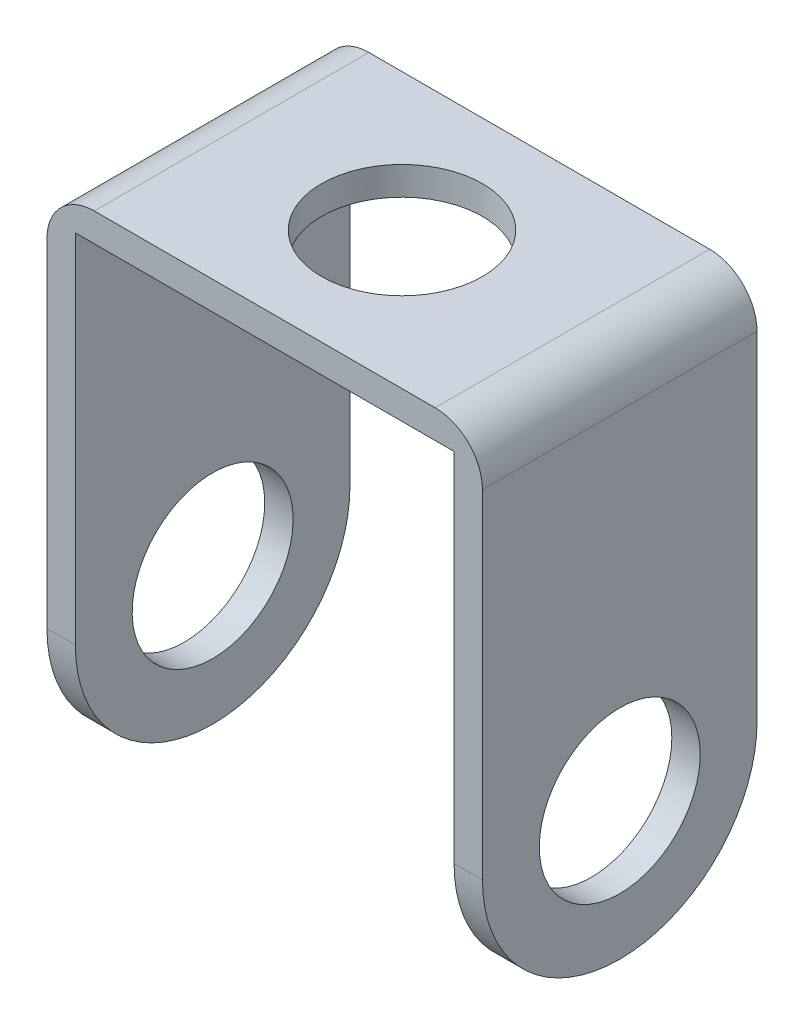
ISO-10303-21;
HEADER;
FILE_DESCRIPTION(('STEP AP214'),'2;1');
FILE_NAME('part.step','',(''),(''),'','','');
FILE_SCHEMA(('AUTOMOTIVE_DESIGN { 1 0 10303 214 1 1 1 1 }'));
ENDSEC;
DATA;
#1=APPLICATION_CONTEXT('core data for automotive mechanical design processes');
#2=APPLICATION_PROTOCOL_DEFINITION('international standard','automotive_design',2000,#1);
#3=PRODUCT_CONTEXT('',#1,'mechanical');
#4=PRODUCT('Part','Part','',(#3));
#5=PRODUCT_RELATED_PRODUCT_CATEGORY('part','',(#4));
#6=PRODUCT_DEFINITION_FORMATION('','',#4);
#7=PRODUCT_DEFINITION_CONTEXT('part definition',#1,'design');
#8=PRODUCT_DEFINITION('design','',#6,#7);
#9=PRODUCT_DEFINITION_SHAPE('','',#8);
#10=(LENGTH_UNIT() NAMED_UNIT(*) SI_UNIT(.MILLI.,.METRE.));
#11=(NAMED_UNIT(*) PLANE_ANGLE_UNIT() SI_UNIT($,.RADIAN.));
#12=(NAMED_UNIT(*) SI_UNIT($,.STERADIAN.) SOLID_ANGLE_UNIT());
#13=UNCERTAINTY_MEASURE_WITH_UNIT(LENGTH_MEASURE(1.E-05),#10,'distance_accuracy_value','');
#14=(GEOMETRIC_REPRESENTATION_CONTEXT(3) GLOBAL_UNCERTAINTY_ASSIGNED_CONTEXT((#13)) GLOBAL_UNIT_ASSIGNED_CONTEXT((#10,
#11,#12)) REPRESENTATION_CONTEXT('',''));
#15=CARTESIAN_POINT('',(0.,0.,0.));
#16=DIRECTION('',(0.,0.,1.));
#17=DIRECTION('',(1.,0.,0.));
#18=AXIS2_PLACEMENT_3D('',#15,#16,#17);
#19=CARTESIAN_POINT('',(0.,0.,7.25));
#20=DIRECTION('',(1.,0.,0.));
#21=DIRECTION('',(0.,0.,-1.));
#22=AXIS2_PLACEMENT_3D('',#19,#20,#21);
#23=PLANE('',#22);
#24=CARTESIAN_POINT('',(0.,3.625,3.625));
#25=DIRECTION('',(1.,0.,0.));
#26=DIRECTION('',(0.,0.,-1.));
#27=AXIS2_PLACEMENT_3D('',#24,#25,#26);
#28=CIRCLE('',#27,2.125);
#29=CARTESIAN_POINT('',(0.,3.625,1.5));
#30=VERTEX_POINT('',#29);
#31=EDGE_CURVE('E115',#30,#30,#28,.T.);
#32=ORIENTED_EDGE('',*,*,#31,.T.);
#33=EDGE_LOOP('',(#32));
#34=FACE_BOUND('',#33,.T.);
#35=CARTESIAN_POINT('',(0.,3.625,3.625));
#36=DIRECTION('',(1.,0.,0.));
#37=DIRECTION('',(0.,0.,-1.));
#38=AXIS2_PLACEMENT_3D('',#35,#36,#37);
#39=CIRCLE('',#38,3.625);
#40=CARTESIAN_POINT('',(0.,3.625,7.25));
#41=VERTEX_POINT('',#40);
#42=CARTESIAN_POINT('',(0.,3.625,0.));
#43=VERTEX_POINT('',#42);
#44=EDGE_CURVE('E48',#41,#43,#39,.T.);
#45=ORIENTED_EDGE('',*,*,#44,.F.);
#46=DIRECTION('',(0.,-1.,0.));
#47=VECTOR('',#46,1.);
#48=CARTESIAN_POINT('',(0.,0.,7.25));
#49=LINE('',#48,#47);
#50=CARTESIAN_POINT('',(0.,12.55,7.25));
#51=VERTEX_POINT('',#50);
#52=EDGE_CURVE('E198',#51,#41,#49,.T.);
#53=ORIENTED_EDGE('',*,*,#52,.F.);
#54=DIRECTION('',(0.,0.,-1.));
#55=VECTOR('',#54,1.);
#56=CARTESIAN_POINT('',(0.,12.55,7.25));
#57=LINE('',#56,#55);
#58=CARTESIAN_POINT('',(0.,12.55,0.));
#59=VERTEX_POINT('',#58);
#60=EDGE_CURVE('E169',#51,#59,#57,.T.);
#61=ORIENTED_EDGE('',*,*,#60,.T.);
#62=DIRECTION('',(0.,-1.,0.));
#63=VECTOR('',#62,1.);
#64=CARTESIAN_POINT('',(0.,0.,0.));
#65=LINE('',#64,#63);
#66=EDGE_CURVE('E140',#59,#43,#65,.T.);
#67=ORIENTED_EDGE('',*,*,#66,.T.);
#68=EDGE_LOOP('',(#45,#53,#61,#67));
#69=FACE_BOUND('',#68,.T.);
#70=ADVANCED_FACE('F31',(#34,#69),#23,.F.);
#71=CARTESIAN_POINT('',(0.749999999999999,13.05,7.25));
#72=DIRECTION('',(-1.,0.,0.));
#73=DIRECTION('',(0.,-1.,0.));
#74=AXIS2_PLACEMENT_3D('',#71,#72,#73);
#75=PLANE('',#74);
#76=CARTESIAN_POINT('',(0.750000000000001,3.625,3.625));
#77=DIRECTION('',(-1.,0.,0.));
#78=DIRECTION('',(0.,-1.,0.));
#79=AXIS2_PLACEMENT_3D('',#76,#77,#78);
#80=CIRCLE('',#79,2.125);
#81=CARTESIAN_POINT('',(0.750000000000001,1.5,3.625));
#82=VERTEX_POINT('',#81);
#83=EDGE_CURVE('E180',#82,#82,#80,.T.);
#84=ORIENTED_EDGE('',*,*,#83,.T.);
#85=EDGE_LOOP('',(#84));
#86=FACE_BOUND('',#85,.T.);
#87=DIRECTION('',(0.,1.,0.));
#88=VECTOR('',#87,1.);
#89=CARTESIAN_POINT('',(0.749999999999999,13.05,7.25));
#90=LINE('',#89,#88);
#91=CARTESIAN_POINT('',(0.750000000000001,3.625,7.25));
#92=VERTEX_POINT('',#91);
#93=CARTESIAN_POINT('',(0.749999999999999,13.05,7.25));
#94=VERTEX_POINT('',#93);
#95=EDGE_CURVE('E201',#92,#94,#90,.T.);
#96=ORIENTED_EDGE('',*,*,#95,.F.);
#97=CARTESIAN_POINT('',(0.750000000000001,3.625,3.625));
#98=DIRECTION('',(-1.,0.,0.));
#99=DIRECTION('',(0.,-1.,0.));
#100=AXIS2_PLACEMENT_3D('',#97,#98,#99);
#101=CIRCLE('',#100,3.625);
#102=CARTESIAN_POINT('',(0.750000000000001,3.625,0.));
#103=VERTEX_POINT('',#102);
#104=EDGE_CURVE('E193',#103,#92,#101,.T.);
#105=ORIENTED_EDGE('',*,*,#104,.F.);
#106=DIRECTION('',(0.,1.,0.));
#107=VECTOR('',#106,1.);
#108=CARTESIAN_POINT('',(0.749999999999999,13.05,0.));
#109=LINE('',#108,#107);
#110=CARTESIAN_POINT('',(0.749999999999999,13.05,0.));
#111=VERTEX_POINT('',#110);
#112=EDGE_CURVE('E143',#103,#111,#109,.T.);
#113=ORIENTED_EDGE('',*,*,#112,.T.);
#114=DIRECTION('',(0.,0.,-1.));
#115=VECTOR('',#114,1.);
#116=CARTESIAN_POINT('',(0.749999999999999,13.05,7.25));
#117=LINE('',#116,#115);
#118=EDGE_CURVE('E166',#94,#111,#117,.T.);
#119=ORIENTED_EDGE('',*,*,#118,.F.);
#120=EDGE_LOOP('',(#96,#105,#113,#119));
#121=FACE_BOUND('',#120,.T.);
#122=ADVANCED_FACE('F232',(#86,#121),#75,.F.);
#123=CARTESIAN_POINT('',(10.75,0.,7.25));
#124=DIRECTION('',(1.,0.,0.));
#125=DIRECTION('',(0.,0.,-1.));
#126=AXIS2_PLACEMENT_3D('',#123,#124,#125);
#127=PLANE('',#126);
#128=CARTESIAN_POINT('',(10.75,3.625,3.625));
#129=DIRECTION('',(1.,0.,0.));
#130=DIRECTION('',(0.,0.,-1.));
#131=AXIS2_PLACEMENT_3D('',#128,#129,#130);
#132=CIRCLE('',#131,2.125);
#133=CARTESIAN_POINT('',(10.75,3.625,1.5));
#134=VERTEX_POINT('',#133);
#135=EDGE_CURVE('E175',#134,#134,#132,.T.);
#136=ORIENTED_EDGE('',*,*,#135,.T.);
#137=EDGE_LOOP('',(#136));
#138=FACE_BOUND('',#137,.T.);
#139=CARTESIAN_POINT('',(10.75,3.625,3.625));
#140=DIRECTION('',(1.,0.,0.));
#141=DIRECTION('',(0.,0.,-1.));
#142=AXIS2_PLACEMENT_3D('',#139,#140,#141);
#143=CIRCLE('',#142,3.625);
#144=CARTESIAN_POINT('',(10.75,3.625,7.25));
#145=VERTEX_POINT('',#144);
#146=CARTESIAN_POINT('',(10.75,3.625,0.));
#147=VERTEX_POINT('',#146);
#148=EDGE_CURVE('E55',#145,#147,#143,.T.);
#149=ORIENTED_EDGE('',*,*,#148,.F.);
#150=DIRECTION('',(0.,-1.,0.));
#151=VECTOR('',#150,1.);
#152=CARTESIAN_POINT('',(10.75,0.,7.25));
#153=LINE('',#152,#151);
#154=CARTESIAN_POINT('',(10.75,13.05,7.25));
#155=VERTEX_POINT('',#154);
#156=EDGE_CURVE('E122',#155,#145,#153,.T.);
#157=ORIENTED_EDGE('',*,*,#156,.F.);
#158=DIRECTION('',(0.,0.,-1.));
#159=VECTOR('',#158,1.);
#160=CARTESIAN_POINT('',(10.75,13.05,7.25));
#161=LINE('',#160,#159);
#162=CARTESIAN_POINT('',(10.75,13.05,0.));
#163=VERTEX_POINT('',#162);
#164=EDGE_CURVE('E163',#155,#163,#161,.T.);
#165=ORIENTED_EDGE('',*,*,#164,.T.);
#166=DIRECTION('',(0.,-1.,0.));
#167=VECTOR('',#166,1.);
#168=CARTESIAN_POINT('',(10.75,0.,0.));
#169=LINE('',#168,#167);
#170=EDGE_CURVE('E147',#163,#147,#169,.T.);
#171=ORIENTED_EDGE('',*,*,#170,.T.);
#172=EDGE_LOOP('',(#149,#157,#165,#171));
#173=FACE_BOUND('',#172,.T.);
#174=ADVANCED_FACE('F212',(#138,#173),#127,.F.);
#175=CARTESIAN_POINT('',(11.5,12.55,7.25));
#176=DIRECTION('',(-1.,0.,0.));
#177=DIRECTION('',(0.,0.,1.));
#178=AXIS2_PLACEMENT_3D('',#175,#176,#177);
#179=PLANE('',#178);
#180=CARTESIAN_POINT('',(11.5,3.625,3.625));
#181=DIRECTION('',(-1.,0.,0.));
#182=DIRECTION('',(0.,0.,1.));
#183=AXIS2_PLACEMENT_3D('',#180,#181,#182);
#184=CIRCLE('',#183,2.125);
#185=CARTESIAN_POINT('',(11.5,3.625,5.75));
#186=VERTEX_POINT('',#185);
#187=EDGE_CURVE('E173',#186,#186,#184,.T.);
#188=ORIENTED_EDGE('',*,*,#187,.T.);
#189=EDGE_LOOP('',(#188));
#190=FACE_BOUND('',#189,.T.);
#191=DIRECTION('',(0.,1.,0.));
#192=VECTOR('',#191,1.);
#193=CARTESIAN_POINT('',(11.5,12.55,7.25));
#194=LINE('',#193,#192);
#195=CARTESIAN_POINT('',(11.5,3.625,7.25));
#196=VERTEX_POINT('',#195);
#197=CARTESIAN_POINT('',(11.5,12.55,7.25));
#198=VERTEX_POINT('',#197);
#199=EDGE_CURVE('E119',#196,#198,#194,.T.);
#200=ORIENTED_EDGE('',*,*,#199,.F.);
#201=CARTESIAN_POINT('',(11.5,3.625,3.625));
#202=DIRECTION('',(-1.,0.,0.));
#203=DIRECTION('',(0.,0.,1.));
#204=AXIS2_PLACEMENT_3D('',#201,#202,#203);
#205=CIRCLE('',#204,3.625);
#206=CARTESIAN_POINT('',(11.5,3.625,0.));
#207=VERTEX_POINT('',#206);
#208=EDGE_CURVE('E107',#207,#196,#205,.T.);
#209=ORIENTED_EDGE('',*,*,#208,.F.);
#210=DIRECTION('',(0.,1.,0.));
#211=VECTOR('',#210,1.);
#212=CARTESIAN_POINT('',(11.5,12.55,0.));
#213=LINE('',#212,#211);
#214=CARTESIAN_POINT('',(11.5,12.55,0.));
#215=VERTEX_POINT('',#214);
#216=EDGE_CURVE('E150',#207,#215,#213,.T.);
#217=ORIENTED_EDGE('',*,*,#216,.T.);
#218=DIRECTION('',(0.,0.,-1.));
#219=VECTOR('',#218,1.);
#220=CARTESIAN_POINT('',(11.5,12.55,7.25));
#221=LINE('',#220,#219);
#222=EDGE_CURVE('E125',#198,#215,#221,.T.);
#223=ORIENTED_EDGE('',*,*,#222,.F.);
#224=EDGE_LOOP('',(#200,#209,#217,#223));
#225=FACE_BOUND('',#224,.T.);
#226=ADVANCED_FACE('F123',(#190,#225),#179,.F.);
#227=CARTESIAN_POINT('',(1.25,12.55,7.25));
#228=DIRECTION('',(0.,0.,-1.));
#229=DIRECTION('',(-1.,0.,0.));
#230=AXIS2_PLACEMENT_3D('',#227,#228,#229);
#231=PLANE('',#230);
#232=DIRECTION('',(-1.,0.,0.));
#233=VECTOR('',#232,1.);
#234=CARTESIAN_POINT('',(50.,3.625,7.25));
#235=LINE('',#234,#233);
#236=EDGE_CURVE('E11',#196,#145,#235,.T.);
#237=ORIENTED_EDGE('',*,*,#236,.F.);
#238=ORIENTED_EDGE('',*,*,#199,.T.);
#239=CARTESIAN_POINT('',(10.25,12.55,7.25));
#240=DIRECTION('',(0.,0.,1.));
#241=DIRECTION('',(-1.,0.,0.));
#242=AXIS2_PLACEMENT_3D('',#239,#240,#241);
#243=CIRCLE('',#242,1.25);
#244=CARTESIAN_POINT('',(10.25,13.8,7.25));
#245=VERTEX_POINT('',#244);
#246=EDGE_CURVE('E127',#198,#245,#243,.T.);
#247=ORIENTED_EDGE('',*,*,#246,.T.);
#248=DIRECTION('',(-1.,0.,0.));
#249=VECTOR('',#248,1.);
#250=CARTESIAN_POINT('',(1.25000000000001,13.8,7.25));
#251=LINE('',#250,#249);
#252=CARTESIAN_POINT('',(1.25000000000001,13.8,7.25));
#253=VERTEX_POINT('',#252);
#254=EDGE_CURVE('E129',#245,#253,#251,.T.);
#255=ORIENTED_EDGE('',*,*,#254,.T.);
#256=CARTESIAN_POINT('',(1.25,12.55,7.25));
#257=DIRECTION('',(0.,0.,1.));
#258=DIRECTION('',(-1.,0.,0.));
#259=AXIS2_PLACEMENT_3D('',#256,#257,#258);
#260=CIRCLE('',#259,1.25);
#261=EDGE_CURVE('E156',#253,#51,#260,.T.);
#262=ORIENTED_EDGE('',*,*,#261,.T.);
#263=ORIENTED_EDGE('',*,*,#52,.T.);
#264=EDGE_CURVE('E40',#92,#41,#235,.T.);
#265=ORIENTED_EDGE('',*,*,#264,.F.);
#266=ORIENTED_EDGE('',*,*,#95,.T.);
#267=DIRECTION('',(1.,0.,0.));
#268=VECTOR('',#267,1.);
#269=CARTESIAN_POINT('',(0.749999999999999,13.05,7.25));
#270=LINE('',#269,#268);
#271=EDGE_CURVE('E131',#94,#155,#270,.T.);
#272=ORIENTED_EDGE('',*,*,#271,.T.);
#273=ORIENTED_EDGE('',*,*,#156,.T.);
#274=EDGE_LOOP('',(#237,#238,#247,#255,#262,#263,#265,#266,#272,#273));
#275=FACE_BOUND('',#274,.T.);
#276=ADVANCED_FACE('F118',(#275),#231,.F.);
#277=CARTESIAN_POINT('',(1.25,12.55,0.));
#278=DIRECTION('',(0.,0.,-1.));
#279=DIRECTION('',(-1.,0.,0.));
#280=AXIS2_PLACEMENT_3D('',#277,#278,#279);
#281=PLANE('',#280);
#282=ORIENTED_EDGE('',*,*,#216,.F.);
#283=DIRECTION('',(-1.,0.,0.));
#284=VECTOR('',#283,1.);
#285=CARTESIAN_POINT('',(50.,3.625,0.));
#286=LINE('',#285,#284);
#287=EDGE_CURVE('E111',#207,#147,#286,.T.);
#288=ORIENTED_EDGE('',*,*,#287,.T.);
#289=ORIENTED_EDGE('',*,*,#170,.F.);
#290=DIRECTION('',(1.,0.,0.));
#291=VECTOR('',#290,1.);
#292=CARTESIAN_POINT('',(0.749999999999999,13.05,0.));
#293=LINE('',#292,#291);
#294=EDGE_CURVE('E145',#111,#163,#293,.T.);
#295=ORIENTED_EDGE('',*,*,#294,.F.);
#296=ORIENTED_EDGE('',*,*,#112,.F.);
#297=EDGE_CURVE('E172',#103,#43,#286,.T.);
#298=ORIENTED_EDGE('',*,*,#297,.T.);
#299=ORIENTED_EDGE('',*,*,#66,.F.);
#300=CARTESIAN_POINT('',(1.25,12.55,0.));
#301=DIRECTION('',(0.,0.,1.));
#302=DIRECTION('',(-1.,0.,0.));
#303=AXIS2_PLACEMENT_3D('',#300,#301,#302);
#304=CIRCLE('',#303,1.25);
#305=CARTESIAN_POINT('',(1.25000000000001,13.8,0.));
#306=VERTEX_POINT('',#305);
#307=EDGE_CURVE('E137',#306,#59,#304,.T.);
#308=ORIENTED_EDGE('',*,*,#307,.F.);
#309=DIRECTION('',(-1.,0.,0.));
#310=VECTOR('',#309,1.);
#311=CARTESIAN_POINT('',(1.25000000000001,13.8,0.));
#312=LINE('',#311,#310);
#313=CARTESIAN_POINT('',(10.25,13.8,0.));
#314=VERTEX_POINT('',#313);
#315=EDGE_CURVE('E154',#314,#306,#312,.T.);
#316=ORIENTED_EDGE('',*,*,#315,.F.);
#317=CARTESIAN_POINT('',(10.25,12.55,0.));
#318=DIRECTION('',(0.,0.,1.));
#319=DIRECTION('',(-1.,0.,0.));
#320=AXIS2_PLACEMENT_3D('',#317,#318,#319);
#321=CIRCLE('',#320,1.25);
#322=EDGE_CURVE('E152',#215,#314,#321,.T.);
#323=ORIENTED_EDGE('',*,*,#322,.F.);
#324=EDGE_LOOP('',(#282,#288,#289,#295,#296,#298,#299,#308,#316,#323));
#325=FACE_BOUND('',#324,.T.);
#326=ADVANCED_FACE('F214',(#325),#281,.T.);
#327=CARTESIAN_POINT('',(1.25,12.55,7.25));
#328=DIRECTION('',(0.,0.,-1.));
#329=DIRECTION('',(-1.,0.,0.));
#330=AXIS2_PLACEMENT_3D('',#327,#328,#329);
#331=CYLINDRICAL_SURFACE('',#330,1.25);
#332=ORIENTED_EDGE('',*,*,#307,.T.);
#333=ORIENTED_EDGE('',*,*,#60,.F.);
#334=ORIENTED_EDGE('',*,*,#261,.F.);
#335=DIRECTION('',(0.,0.,-1.));
#336=VECTOR('',#335,1.);
#337=CARTESIAN_POINT('',(1.25000000000001,13.8,7.25));
#338=LINE('',#337,#336);
#339=EDGE_CURVE('E136',#253,#306,#338,.T.);
#340=ORIENTED_EDGE('',*,*,#339,.T.);
#341=EDGE_LOOP('',(#332,#333,#334,#340));
#342=FACE_BOUND('',#341,.T.);
#343=ADVANCED_FACE('F33',(#342),#331,.T.);
#344=CARTESIAN_POINT('',(0.749999999999999,13.05,7.25));
#345=DIRECTION('',(0.,1.,0.));
#346=DIRECTION('',(0.,0.,1.));
#347=AXIS2_PLACEMENT_3D('',#344,#345,#346);
#348=PLANE('',#347);
#349=CARTESIAN_POINT('',(5.75,13.05,3.625));
#350=DIRECTION('',(0.,1.,0.));
#351=DIRECTION('',(0.,0.,1.));
#352=AXIS2_PLACEMENT_3D('',#349,#350,#351);
#353=CIRCLE('',#352,2.125);
#354=CARTESIAN_POINT('',(5.75,13.05,5.75));
#355=VERTEX_POINT('',#354);
#356=EDGE_CURVE('E176',#355,#355,#353,.T.);
#357=ORIENTED_EDGE('',*,*,#356,.T.);
#358=EDGE_LOOP('',(#357));
#359=FACE_BOUND('',#358,.T.);
#360=ORIENTED_EDGE('',*,*,#294,.T.);
#361=ORIENTED_EDGE('',*,*,#164,.F.);
#362=ORIENTED_EDGE('',*,*,#271,.F.);
#363=ORIENTED_EDGE('',*,*,#118,.T.);
#364=EDGE_LOOP('',(#360,#361,#362,#363));
#365=FACE_BOUND('',#364,.T.);
#366=ADVANCED_FACE('F208',(#359,#365),#348,.F.);
#367=CARTESIAN_POINT('',(10.25,12.55,7.25));
#368=DIRECTION('',(0.,0.,-1.));
#369=DIRECTION('',(-1.,0.,0.));
#370=AXIS2_PLACEMENT_3D('',#367,#368,#369);
#371=CYLINDRICAL_SURFACE('',#370,1.25);
#372=ORIENTED_EDGE('',*,*,#322,.T.);
#373=DIRECTION('',(0.,0.,-1.));
#374=VECTOR('',#373,1.);
#375=CARTESIAN_POINT('',(10.25,13.8,7.25));
#376=LINE('',#375,#374);
#377=EDGE_CURVE('E159',#245,#314,#376,.T.);
#378=ORIENTED_EDGE('',*,*,#377,.F.);
#379=ORIENTED_EDGE('',*,*,#246,.F.);
#380=ORIENTED_EDGE('',*,*,#222,.T.);
#381=EDGE_LOOP('',(#372,#378,#379,#380));
#382=FACE_BOUND('',#381,.T.);
#383=ADVANCED_FACE('F219',(#382),#371,.T.);
#384=CARTESIAN_POINT('',(1.25000000000001,13.8,7.25));
#385=DIRECTION('',(0.,-1.,0.));
#386=DIRECTION('',(1.,0.,0.));
#387=AXIS2_PLACEMENT_3D('',#384,#385,#386);
#388=PLANE('',#387);
#389=CARTESIAN_POINT('',(5.75,13.8,3.625));
#390=DIRECTION('',(0.,-1.,0.));
#391=DIRECTION('',(1.,0.,0.));
#392=AXIS2_PLACEMENT_3D('',#389,#390,#391);
#393=CIRCLE('',#392,2.125);
#394=CARTESIAN_POINT('',(7.875,13.8,3.625));
#395=VERTEX_POINT('',#394);
#396=EDGE_CURVE('E35',#395,#395,#393,.T.);
#397=ORIENTED_EDGE('',*,*,#396,.T.);
#398=EDGE_LOOP('',(#397));
#399=FACE_BOUND('',#398,.T.);
#400=ORIENTED_EDGE('',*,*,#315,.T.);
#401=ORIENTED_EDGE('',*,*,#339,.F.);
#402=ORIENTED_EDGE('',*,*,#254,.F.);
#403=ORIENTED_EDGE('',*,*,#377,.T.);
#404=EDGE_LOOP('',(#400,#401,#402,#403));
#405=FACE_BOUND('',#404,.T.);
#406=ADVANCED_FACE('F226',(#399,#405),#388,.F.);
#407=CARTESIAN_POINT('',(50.,3.625,3.625));
#408=DIRECTION('',(-1.,0.,0.));
#409=DIRECTION('',(0.,0.,1.));
#410=AXIS2_PLACEMENT_3D('',#407,#408,#409);
#411=CYLINDRICAL_SURFACE('',#410,3.625);
#412=ORIENTED_EDGE('',*,*,#44,.T.);
#413=ORIENTED_EDGE('',*,*,#297,.F.);
#414=ORIENTED_EDGE('',*,*,#104,.T.);
#415=ORIENTED_EDGE('',*,*,#264,.T.);
#416=EDGE_LOOP('',(#412,#413,#414,#415));
#417=FACE_BOUND('',#416,.T.);
#418=ADVANCED_FACE('F233',(#417),#411,.T.);
#419=ORIENTED_EDGE('',*,*,#148,.T.);
#420=ORIENTED_EDGE('',*,*,#287,.F.);
#421=ORIENTED_EDGE('',*,*,#208,.T.);
#422=ORIENTED_EDGE('',*,*,#236,.T.);
#423=EDGE_LOOP('',(#419,#420,#421,#422));
#424=FACE_BOUND('',#423,.T.);
#425=ADVANCED_FACE('F109',(#424),#411,.T.);
#426=CARTESIAN_POINT('',(50.,3.625,3.625));
#427=DIRECTION('',(-1.,0.,0.));
#428=DIRECTION('',(0.,0.,1.));
#429=AXIS2_PLACEMENT_3D('',#426,#427,#428);
#430=CYLINDRICAL_SURFACE('',#429,2.125);
#431=ORIENTED_EDGE('',*,*,#187,.F.);
#432=EDGE_LOOP('',(#431));
#433=FACE_BOUND('',#432,.T.);
#434=ORIENTED_EDGE('',*,*,#135,.F.);
#435=EDGE_LOOP('',(#434));
#436=FACE_BOUND('',#435,.T.);
#437=ADVANCED_FACE('F240',(#433,#436),#430,.F.);
#438=ORIENTED_EDGE('',*,*,#83,.F.);
#439=EDGE_LOOP('',(#438));
#440=FACE_BOUND('',#439,.T.);
#441=ORIENTED_EDGE('',*,*,#31,.F.);
#442=EDGE_LOOP('',(#441));
#443=FACE_BOUND('',#442,.T.);
#444=ADVANCED_FACE('F299',(#440,#443),#430,.F.);
#445=CARTESIAN_POINT('',(5.75000000000001,-36.2,3.625));
#446=DIRECTION('',(0.,1.,0.));
#447=DIRECTION('',(-1.,0.,0.));
#448=AXIS2_PLACEMENT_3D('',#445,#446,#447);
#449=CYLINDRICAL_SURFACE('',#448,2.125);
#450=ORIENTED_EDGE('',*,*,#396,.F.);
#451=EDGE_LOOP('',(#450));
#452=FACE_BOUND('',#451,.T.);
#453=ORIENTED_EDGE('',*,*,#356,.F.);
#454=EDGE_LOOP('',(#453));
#455=FACE_BOUND('',#454,.T.);
#456=ADVANCED_FACE('F295',(#452,#455),#449,.F.);
#457=CLOSED_SHELL('',(#70,#122,#174,#226,#276,#326,#343,#366,#383,#406,#418,#425,#437,#444,#456));
#458=MANIFOLD_SOLID_BREP('B2',#457);
#459=ADVANCED_BREP_SHAPE_REPRESENTATION('',(#18,#458),#14);
#460=SHAPE_DEFINITION_REPRESENTATION(#9,#459);
ENDSEC;
END-ISO-10303-21;
